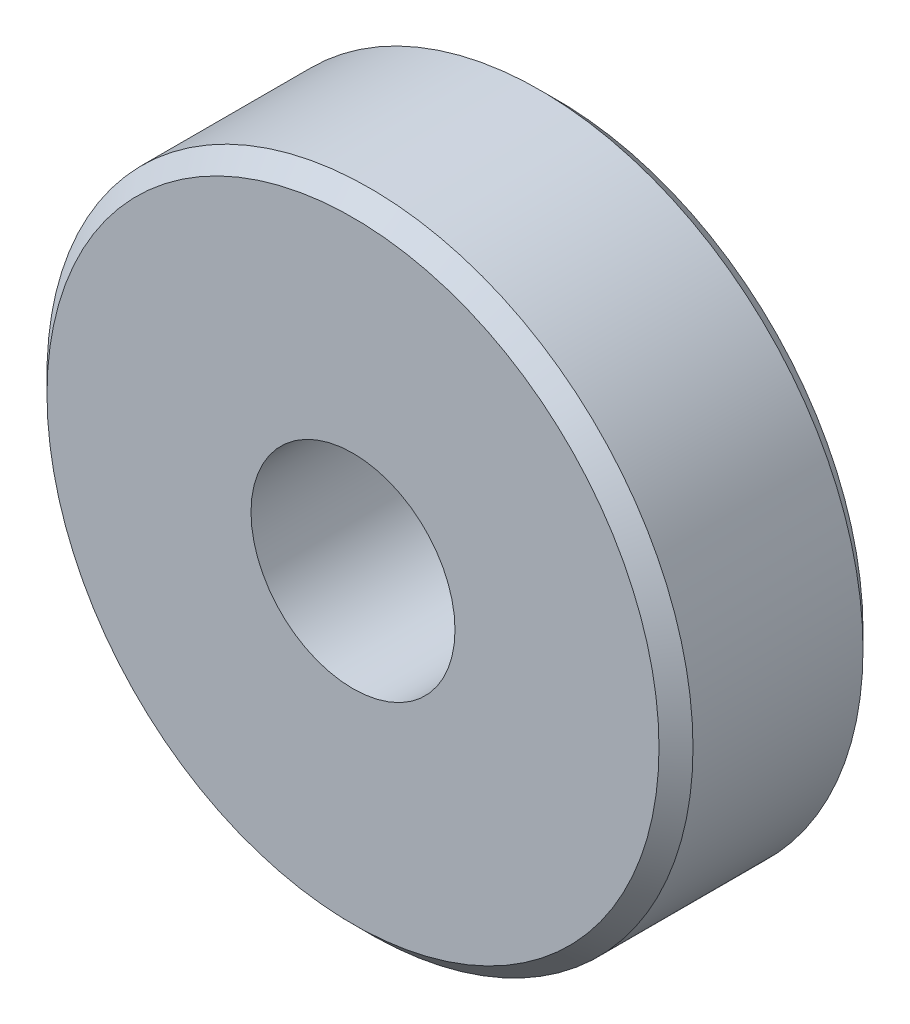
ISO-10303-21;
HEADER;
FILE_DESCRIPTION(('STEP AP214'),'2;1');
FILE_NAME('part.step','',(''),(''),'','','');
FILE_SCHEMA(('AUTOMOTIVE_DESIGN { 1 0 10303 214 1 1 1 1 }'));
ENDSEC;
DATA;
#1=APPLICATION_CONTEXT('core data for automotive mechanical design processes');
#2=APPLICATION_PROTOCOL_DEFINITION('international standard','automotive_design',2000,#1);
#3=PRODUCT_CONTEXT('',#1,'mechanical');
#4=PRODUCT('Part','Part','',(#3));
#5=PRODUCT_RELATED_PRODUCT_CATEGORY('part','',(#4));
#6=PRODUCT_DEFINITION_FORMATION('','',#4);
#7=PRODUCT_DEFINITION_CONTEXT('part definition',#1,'design');
#8=PRODUCT_DEFINITION('design','',#6,#7);
#9=PRODUCT_DEFINITION_SHAPE('','',#8);
#10=(LENGTH_UNIT() NAMED_UNIT(*) SI_UNIT(.MILLI.,.METRE.));
#11=(NAMED_UNIT(*) PLANE_ANGLE_UNIT() SI_UNIT($,.RADIAN.));
#12=(NAMED_UNIT(*) SI_UNIT($,.STERADIAN.) SOLID_ANGLE_UNIT());
#13=UNCERTAINTY_MEASURE_WITH_UNIT(LENGTH_MEASURE(1.E-05),#10,'distance_accuracy_value','');
#14=(GEOMETRIC_REPRESENTATION_CONTEXT(3) GLOBAL_UNCERTAINTY_ASSIGNED_CONTEXT((#13)) GLOBAL_UNIT_ASSIGNED_CONTEXT((#10,
#11,#12)) REPRESENTATION_CONTEXT('',''));
#15=CARTESIAN_POINT('',(0.,0.,0.));
#16=DIRECTION('',(0.,0.,1.));
#17=DIRECTION('',(1.,0.,0.));
#18=AXIS2_PLACEMENT_3D('',#15,#16,#17);
#19=CARTESIAN_POINT('',(0.,0.,3.));
#20=DIRECTION('',(0.,0.,1.));
#21=DIRECTION('',(1.,0.,0.));
#22=AXIS2_PLACEMENT_3D('',#19,#20,#21);
#23=PLANE('',#22);
#24=CARTESIAN_POINT('',(0.,0.,3.));
#25=DIRECTION('',(0.,0.,1.));
#26=DIRECTION('',(1.,0.,0.));
#27=AXIS2_PLACEMENT_3D('',#24,#25,#26);
#28=CIRCLE('',#27,9.);
#29=CARTESIAN_POINT('',(9.,0.,3.));
#30=VERTEX_POINT('',#29);
#31=EDGE_CURVE('E10',#30,#30,#28,.T.);
#32=ORIENTED_EDGE('',*,*,#31,.T.);
#33=EDGE_LOOP('',(#32));
#34=FACE_BOUND('',#33,.T.);
#35=CARTESIAN_POINT('',(0.,0.,3.));
#36=DIRECTION('',(0.,0.,1.));
#37=DIRECTION('',(1.,0.,0.));
#38=AXIS2_PLACEMENT_3D('',#35,#36,#37);
#39=CIRCLE('',#38,3.);
#40=CARTESIAN_POINT('',(3.,0.,3.));
#41=VERTEX_POINT('',#40);
#42=EDGE_CURVE('E50',#41,#41,#39,.T.);
#43=ORIENTED_EDGE('',*,*,#42,.F.);
#44=EDGE_LOOP('',(#43));
#45=FACE_BOUND('',#44,.T.);
#46=ADVANCED_FACE('F30',(#34,#45),#23,.T.);
#47=CARTESIAN_POINT('',(0.,0.,-3.));
#48=DIRECTION('',(0.,0.,1.));
#49=DIRECTION('',(1.,0.,0.));
#50=AXIS2_PLACEMENT_3D('',#47,#48,#49);
#51=PLANE('',#50);
#52=CARTESIAN_POINT('',(0.,0.,-3.));
#53=DIRECTION('',(0.,0.,1.));
#54=DIRECTION('',(1.,0.,0.));
#55=AXIS2_PLACEMENT_3D('',#52,#53,#54);
#56=CIRCLE('',#55,9.);
#57=CARTESIAN_POINT('',(9.,0.,-3.));
#58=VERTEX_POINT('',#57);
#59=EDGE_CURVE('E37',#58,#58,#56,.F.);
#60=ORIENTED_EDGE('',*,*,#59,.T.);
#61=EDGE_LOOP('',(#60));
#62=FACE_BOUND('',#61,.T.);
#63=CARTESIAN_POINT('',(0.,0.,-3.));
#64=DIRECTION('',(0.,0.,1.));
#65=DIRECTION('',(1.,0.,0.));
#66=AXIS2_PLACEMENT_3D('',#63,#64,#65);
#67=CIRCLE('',#66,3.);
#68=CARTESIAN_POINT('',(3.,0.,-3.));
#69=VERTEX_POINT('',#68);
#70=EDGE_CURVE('E51',#69,#69,#67,.T.);
#71=ORIENTED_EDGE('',*,*,#70,.T.);
#72=EDGE_LOOP('',(#71));
#73=FACE_BOUND('',#72,.T.);
#74=ADVANCED_FACE('F61',(#62,#73),#51,.F.);
#75=CARTESIAN_POINT('',(0.,0.,3.));
#76=DIRECTION('',(0.,0.,-1.));
#77=DIRECTION('',(-1.,0.,0.));
#78=AXIS2_PLACEMENT_3D('',#75,#76,#77);
#79=CYLINDRICAL_SURFACE('',#78,9.5);
#80=CARTESIAN_POINT('',(0.,0.,-2.5));
#81=DIRECTION('',(0.,0.,1.));
#82=DIRECTION('',(1.,0.,0.));
#83=AXIS2_PLACEMENT_3D('',#80,#81,#82);
#84=CIRCLE('',#83,9.5);
#85=CARTESIAN_POINT('',(9.5,0.,-2.5));
#86=VERTEX_POINT('',#85);
#87=EDGE_CURVE('E41',#86,#86,#84,.T.);
#88=ORIENTED_EDGE('',*,*,#87,.T.);
#89=EDGE_LOOP('',(#88));
#90=FACE_BOUND('',#89,.T.);
#91=CARTESIAN_POINT('',(0.,0.,2.5));
#92=DIRECTION('',(0.,0.,1.));
#93=DIRECTION('',(1.,0.,0.));
#94=AXIS2_PLACEMENT_3D('',#91,#92,#93);
#95=CIRCLE('',#94,9.5);
#96=CARTESIAN_POINT('',(9.5,0.,2.5));
#97=VERTEX_POINT('',#96);
#98=EDGE_CURVE('E45',#97,#97,#95,.F.);
#99=ORIENTED_EDGE('',*,*,#98,.T.);
#100=EDGE_LOOP('',(#99));
#101=FACE_BOUND('',#100,.T.);
#102=ADVANCED_FACE('F66',(#90,#101),#79,.T.);
#103=CARTESIAN_POINT('',(0.,0.,3.));
#104=DIRECTION('',(0.,0.,-1.));
#105=DIRECTION('',(-1.,0.,0.));
#106=AXIS2_PLACEMENT_3D('',#103,#104,#105);
#107=CYLINDRICAL_SURFACE('',#106,3.);
#108=ORIENTED_EDGE('',*,*,#42,.T.);
#109=EDGE_LOOP('',(#108));
#110=FACE_BOUND('',#109,.T.);
#111=ORIENTED_EDGE('',*,*,#70,.F.);
#112=EDGE_LOOP('',(#111));
#113=FACE_BOUND('',#112,.T.);
#114=ADVANCED_FACE('F57',(#110,#113),#107,.F.);
#115=CARTESIAN_POINT('',(0.,0.,-2.5));
#116=DIRECTION('',(0.,0.,1.));
#117=DIRECTION('',(1.,0.,0.));
#118=AXIS2_PLACEMENT_3D('',#115,#116,#117);
#119=CONICAL_SURFACE('',#118,9.5,0.785398163397448);
#120=ORIENTED_EDGE('',*,*,#59,.F.);
#121=EDGE_LOOP('',(#120));
#122=FACE_BOUND('',#121,.T.);
#123=ORIENTED_EDGE('',*,*,#87,.F.);
#124=EDGE_LOOP('',(#123));
#125=FACE_BOUND('',#124,.T.);
#126=ADVANCED_FACE('F72',(#122,#125),#119,.T.);
#127=CARTESIAN_POINT('',(0.,0.,3.));
#128=DIRECTION('',(0.,0.,-1.));
#129=DIRECTION('',(-1.,0.,0.));
#130=AXIS2_PLACEMENT_3D('',#127,#128,#129);
#131=CONICAL_SURFACE('',#130,9.,0.785398163397447);
#132=ORIENTED_EDGE('',*,*,#98,.F.);
#133=EDGE_LOOP('',(#132));
#134=FACE_BOUND('',#133,.T.);
#135=ORIENTED_EDGE('',*,*,#31,.F.);
#136=EDGE_LOOP('',(#135));
#137=FACE_BOUND('',#136,.T.);
#138=ADVANCED_FACE('F32',(#134,#137),#131,.T.);
#139=CLOSED_SHELL('',(#46,#74,#102,#114,#126,#138));
#140=MANIFOLD_SOLID_BREP('B2',#139);
#141=ADVANCED_BREP_SHAPE_REPRESENTATION('',(#18,#140),#14);
#142=SHAPE_DEFINITION_REPRESENTATION(#9,#141);
ENDSEC;
END-ISO-10303-21;
